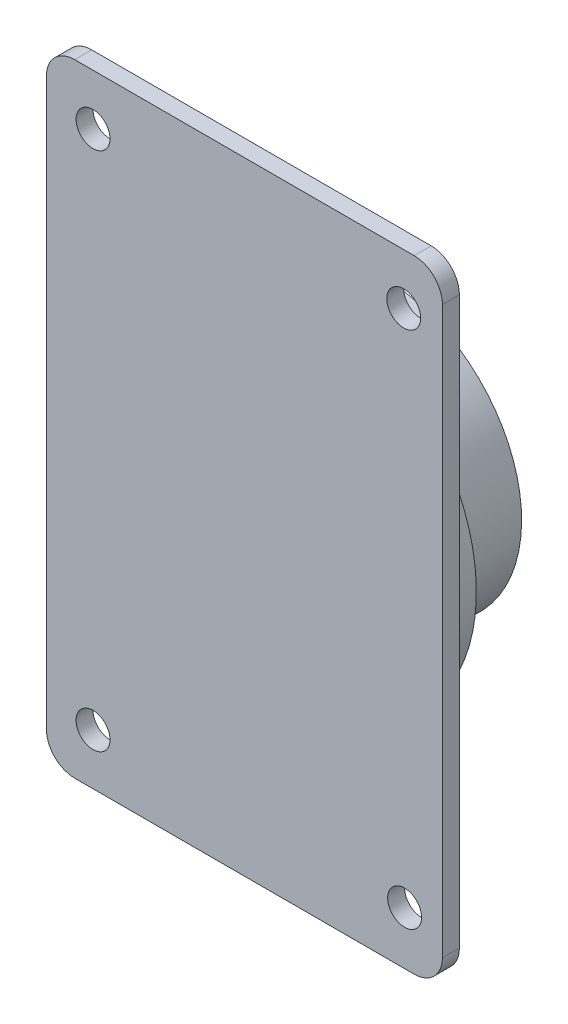
ISO-10303-21;
HEADER;
FILE_DESCRIPTION(('STEP AP214'),'2;1');
FILE_NAME('part.step','',(''),(''),'','','');
FILE_SCHEMA(('AUTOMOTIVE_DESIGN { 1 0 10303 214 1 1 1 1 }'));
ENDSEC;
DATA;
#1=APPLICATION_CONTEXT('core data for automotive mechanical design processes');
#2=APPLICATION_PROTOCOL_DEFINITION('international standard','automotive_design',2000,#1);
#3=PRODUCT_CONTEXT('',#1,'mechanical');
#4=PRODUCT('Part','Part','',(#3));
#5=PRODUCT_RELATED_PRODUCT_CATEGORY('part','',(#4));
#6=PRODUCT_DEFINITION_FORMATION('','',#4);
#7=PRODUCT_DEFINITION_CONTEXT('part definition',#1,'design');
#8=PRODUCT_DEFINITION('design','',#6,#7);
#9=PRODUCT_DEFINITION_SHAPE('','',#8);
#10=(LENGTH_UNIT() NAMED_UNIT(*) SI_UNIT(.MILLI.,.METRE.));
#11=(NAMED_UNIT(*) PLANE_ANGLE_UNIT() SI_UNIT($,.RADIAN.));
#12=(NAMED_UNIT(*) SI_UNIT($,.STERADIAN.) SOLID_ANGLE_UNIT());
#13=UNCERTAINTY_MEASURE_WITH_UNIT(LENGTH_MEASURE(1.E-05),#10,'distance_accuracy_value','');
#14=(GEOMETRIC_REPRESENTATION_CONTEXT(3) GLOBAL_UNCERTAINTY_ASSIGNED_CONTEXT((#13)) GLOBAL_UNIT_ASSIGNED_CONTEXT((#10,
#11,#12)) REPRESENTATION_CONTEXT('',''));
#15=CARTESIAN_POINT('',(0.,0.,0.));
#16=DIRECTION('',(0.,0.,1.));
#17=DIRECTION('',(1.,0.,0.));
#18=AXIS2_PLACEMENT_3D('',#15,#16,#17);
#19=CARTESIAN_POINT('',(0.,-3.14233320495882E-13,90.));
#20=DIRECTION('',(0.,0.,-1.));
#21=DIRECTION('',(0.,-1.,0.));
#22=AXIS2_PLACEMENT_3D('',#19,#20,#21);
#23=CYLINDRICAL_SURFACE('',#22,25.);
#24=CARTESIAN_POINT('',(0.,-3.14233320495882E-13,90.));
#25=DIRECTION('',(0.,0.,-1.));
#26=DIRECTION('',(0.,-1.,0.));
#27=AXIS2_PLACEMENT_3D('',#24,#25,#26);
#28=CIRCLE('',#27,25.);
#29=CARTESIAN_POINT('',(1.74574066942159E-13,-25.0000000000003,89.9999999999999));
#30=VERTEX_POINT('',#29);
#31=EDGE_CURVE('E146',#30,#30,#28,.T.);
#32=ORIENTED_EDGE('',*,*,#31,.T.);
#33=EDGE_LOOP('',(#32));
#34=FACE_BOUND('',#33,.T.);
#35=CARTESIAN_POINT('',(0.,-2.61861100413235E-13,75.));
#36=DIRECTION('',(0.,0.,-1.));
#37=DIRECTION('',(0.,-1.,0.));
#38=AXIS2_PLACEMENT_3D('',#35,#36,#37);
#39=CIRCLE('',#38,25.);
#40=CARTESIAN_POINT('',(1.74574066942158E-13,-25.0000000000003,74.9999999999999));
#41=VERTEX_POINT('',#40);
#42=EDGE_CURVE('E121',#41,#41,#39,.T.);
#43=ORIENTED_EDGE('',*,*,#42,.F.);
#44=EDGE_LOOP('',(#43));
#45=FACE_BOUND('',#44,.T.);
#46=ADVANCED_FACE('F34',(#34,#45),#23,.T.);
#47=CARTESIAN_POINT('',(0.,-2.61861100413235E-13,75.));
#48=DIRECTION('',(0.,0.,-1.));
#49=DIRECTION('',(0.,-1.,0.));
#50=AXIS2_PLACEMENT_3D('',#47,#48,#49);
#51=PLANE('',#50);
#52=ORIENTED_EDGE('',*,*,#42,.T.);
#53=EDGE_LOOP('',(#52));
#54=FACE_BOUND('',#53,.T.);
#55=ADVANCED_FACE('F206',(#54),#51,.T.);
#56=CARTESIAN_POINT('',(0.,-3.35182208528941E-13,96.));
#57=DIRECTION('',(0.,0.,-1.));
#58=DIRECTION('',(0.,-1.,0.));
#59=AXIS2_PLACEMENT_3D('',#56,#57,#58);
#60=CYLINDRICAL_SURFACE('',#59,32.);
#61=CARTESIAN_POINT('',(0.,-3.35182208528941E-13,96.));
#62=DIRECTION('',(0.,0.,1.));
#63=DIRECTION('',(0.,1.,0.));
#64=AXIS2_PLACEMENT_3D('',#61,#62,#63);
#65=CIRCLE('',#64,32.);
#66=CARTESIAN_POINT('',(-2.23454805685958E-13,31.9999999999997,96.0000000000001));
#67=VERTEX_POINT('',#66);
#68=EDGE_CURVE('E143',#67,#67,#65,.T.);
#69=ORIENTED_EDGE('',*,*,#68,.F.);
#70=EDGE_LOOP('',(#69));
#71=FACE_BOUND('',#70,.T.);
#72=CARTESIAN_POINT('',(0.,-3.14233320495882E-13,90.));
#73=DIRECTION('',(0.,0.,1.));
#74=DIRECTION('',(0.,1.,0.));
#75=AXIS2_PLACEMENT_3D('',#72,#73,#74);
#76=CIRCLE('',#75,32.);
#77=CARTESIAN_POINT('',(-2.23454805685958E-13,31.9999999999997,90.0000000000001));
#78=VERTEX_POINT('',#77);
#79=EDGE_CURVE('E147',#78,#78,#76,.T.);
#80=ORIENTED_EDGE('',*,*,#79,.T.);
#81=EDGE_LOOP('',(#80));
#82=FACE_BOUND('',#81,.T.);
#83=ADVANCED_FACE('F212',(#71,#82),#60,.T.);
#84=CARTESIAN_POINT('',(0.,-3.14233320495882E-13,90.));
#85=DIRECTION('',(0.,0.,1.));
#86=DIRECTION('',(0.,1.,0.));
#87=AXIS2_PLACEMENT_3D('',#84,#85,#86);
#88=PLANE('',#87);
#89=ORIENTED_EDGE('',*,*,#31,.F.);
#90=EDGE_LOOP('',(#89));
#91=FACE_BOUND('',#90,.T.);
#92=ORIENTED_EDGE('',*,*,#79,.F.);
#93=EDGE_LOOP('',(#92));
#94=FACE_BOUND('',#93,.T.);
#95=ADVANCED_FACE('F240',(#91,#94),#88,.F.);
#96=CARTESIAN_POINT('',(35.0000000000004,-55.0000000000001,98.9999999999998));
#97=DIRECTION('',(0.,1.,0.));
#98=DIRECTION('',(1.,0.,0.));
#99=AXIS2_PLACEMENT_3D('',#96,#97,#98);
#100=PLANE('',#99);
#101=DIRECTION('',(1.,0.,0.));
#102=VECTOR('',#101,1.);
#103=CARTESIAN_POINT('',(35.0000000000004,-55.0000000000001,95.9999999999998));
#104=LINE('',#103,#102);
#105=CARTESIAN_POINT('',(-29.9999999999996,-55.0000000000005,95.9999999999998));
#106=VERTEX_POINT('',#105);
#107=CARTESIAN_POINT('',(30.0000000000004,-55.0000000000001,95.9999999999998));
#108=VERTEX_POINT('',#107);
#109=EDGE_CURVE('E117',#106,#108,#104,.T.);
#110=ORIENTED_EDGE('',*,*,#109,.T.);
#111=DIRECTION('',(0.,0.,-1.));
#112=VECTOR('',#111,1.);
#113=CARTESIAN_POINT('',(30.0000000000004,-55.0000000000001,98.9999999999998));
#114=LINE('',#113,#112);
#115=CARTESIAN_POINT('',(30.0000000000004,-55.0000000000001,98.9999999999998));
#116=VERTEX_POINT('',#115);
#117=EDGE_CURVE('E167',#108,#116,#114,.F.);
#118=ORIENTED_EDGE('',*,*,#117,.T.);
#119=DIRECTION('',(1.,0.,0.));
#120=VECTOR('',#119,1.);
#121=CARTESIAN_POINT('',(35.0000000000004,-55.0000000000001,98.9999999999998));
#122=LINE('',#121,#120);
#123=CARTESIAN_POINT('',(-29.9999999999996,-55.0000000000005,98.9999999999998));
#124=VERTEX_POINT('',#123);
#125=EDGE_CURVE('E120',#124,#116,#122,.T.);
#126=ORIENTED_EDGE('',*,*,#125,.F.);
#127=DIRECTION('',(0.,0.,-1.));
#128=VECTOR('',#127,1.);
#129=CARTESIAN_POINT('',(-29.9999999999996,-55.0000000000005,98.9999999999998));
#130=LINE('',#129,#128);
#131=EDGE_CURVE('E106',#124,#106,#130,.T.);
#132=ORIENTED_EDGE('',*,*,#131,.T.);
#133=EDGE_LOOP('',(#110,#118,#126,#132));
#134=FACE_BOUND('',#133,.T.);
#135=ADVANCED_FACE('F116',(#134),#100,.F.);
#136=CARTESIAN_POINT('',(34.9999999999996,54.9999999999999,99.0000000000002));
#137=DIRECTION('',(-1.,0.,0.));
#138=DIRECTION('',(0.,1.,0.));
#139=AXIS2_PLACEMENT_3D('',#136,#137,#138);
#140=PLANE('',#139);
#141=DIRECTION('',(0.,1.,0.));
#142=VECTOR('',#141,1.);
#143=CARTESIAN_POINT('',(34.9999999999996,54.9999999999999,99.0000000000002));
#144=LINE('',#143,#142);
#145=CARTESIAN_POINT('',(35.0000000000003,-50.0000000000001,98.9999999999998));
#146=VERTEX_POINT('',#145);
#147=CARTESIAN_POINT('',(34.9999999999997,49.9999999999999,99.0000000000002));
#148=VERTEX_POINT('',#147);
#149=EDGE_CURVE('E186',#146,#148,#144,.T.);
#150=ORIENTED_EDGE('',*,*,#149,.F.);
#151=DIRECTION('',(0.,0.,-1.));
#152=VECTOR('',#151,1.);
#153=CARTESIAN_POINT('',(35.0000000000003,-50.0000000000001,98.9999999999998));
#154=LINE('',#153,#152);
#155=CARTESIAN_POINT('',(35.0000000000003,-50.0000000000001,95.9999999999998));
#156=VERTEX_POINT('',#155);
#157=EDGE_CURVE('E159',#146,#156,#154,.T.);
#158=ORIENTED_EDGE('',*,*,#157,.T.);
#159=DIRECTION('',(0.,1.,0.));
#160=VECTOR('',#159,1.);
#161=CARTESIAN_POINT('',(34.9999999999996,54.9999999999999,96.0000000000002));
#162=LINE('',#161,#160);
#163=CARTESIAN_POINT('',(34.9999999999997,49.9999999999999,96.0000000000002));
#164=VERTEX_POINT('',#163);
#165=EDGE_CURVE('E126',#156,#164,#162,.T.);
#166=ORIENTED_EDGE('',*,*,#165,.T.);
#167=DIRECTION('',(0.,0.,-1.));
#168=VECTOR('',#167,1.);
#169=CARTESIAN_POINT('',(34.9999999999997,49.9999999999999,99.0000000000002));
#170=LINE('',#169,#168);
#171=EDGE_CURVE('E157',#164,#148,#170,.F.);
#172=ORIENTED_EDGE('',*,*,#171,.T.);
#173=EDGE_LOOP('',(#150,#158,#166,#172));
#174=FACE_BOUND('',#173,.T.);
#175=ADVANCED_FACE('F231',(#174),#140,.F.);
#176=CARTESIAN_POINT('',(-35.0000000000004,54.9999999999994,99.0000000000002));
#177=DIRECTION('',(0.,-1.,0.));
#178=DIRECTION('',(-1.,0.,0.));
#179=AXIS2_PLACEMENT_3D('',#176,#177,#178);
#180=PLANE('',#179);
#181=DIRECTION('',(-1.,0.,0.));
#182=VECTOR('',#181,1.);
#183=CARTESIAN_POINT('',(-35.0000000000004,54.9999999999994,99.0000000000002));
#184=LINE('',#183,#182);
#185=CARTESIAN_POINT('',(29.9999999999996,54.9999999999999,99.0000000000002));
#186=VERTEX_POINT('',#185);
#187=CARTESIAN_POINT('',(-30.0000000000004,54.9999999999994,99.0000000000002));
#188=VERTEX_POINT('',#187);
#189=EDGE_CURVE('E136',#186,#188,#184,.T.);
#190=ORIENTED_EDGE('',*,*,#189,.F.);
#191=DIRECTION('',(0.,0.,-1.));
#192=VECTOR('',#191,1.);
#193=CARTESIAN_POINT('',(29.9999999999996,54.9999999999999,99.0000000000002));
#194=LINE('',#193,#192);
#195=CARTESIAN_POINT('',(29.9999999999996,54.9999999999999,96.0000000000002));
#196=VERTEX_POINT('',#195);
#197=EDGE_CURVE('E42',#186,#196,#194,.T.);
#198=ORIENTED_EDGE('',*,*,#197,.T.);
#199=DIRECTION('',(-1.,0.,0.));
#200=VECTOR('',#199,1.);
#201=CARTESIAN_POINT('',(-35.0000000000004,54.9999999999994,96.0000000000002));
#202=LINE('',#201,#200);
#203=CARTESIAN_POINT('',(-30.0000000000004,54.9999999999995,96.0000000000002));
#204=VERTEX_POINT('',#203);
#205=EDGE_CURVE('E130',#196,#204,#202,.T.);
#206=ORIENTED_EDGE('',*,*,#205,.T.);
#207=DIRECTION('',(0.,0.,-1.));
#208=VECTOR('',#207,1.);
#209=CARTESIAN_POINT('',(-30.0000000000004,54.9999999999994,99.0000000000002));
#210=LINE('',#209,#208);
#211=EDGE_CURVE('E49',#204,#188,#210,.F.);
#212=ORIENTED_EDGE('',*,*,#211,.T.);
#213=EDGE_LOOP('',(#190,#198,#206,#212));
#214=FACE_BOUND('',#213,.T.);
#215=ADVANCED_FACE('F177',(#214),#180,.F.);
#216=CARTESIAN_POINT('',(-35.,-5.9006034626449E-13,99.));
#217=DIRECTION('',(1.,0.,0.));
#218=DIRECTION('',(0.,-1.,0.));
#219=AXIS2_PLACEMENT_3D('',#216,#217,#218);
#220=PLANE('',#219);
#221=DIRECTION('',(0.,-1.,0.));
#222=VECTOR('',#221,1.);
#223=CARTESIAN_POINT('',(-34.9999999999996,-55.0000000000006,98.9999999999998));
#224=LINE('',#223,#222);
#225=CARTESIAN_POINT('',(-35.0000000000003,49.9999999999994,99.0000000000002));
#226=VERTEX_POINT('',#225);
#227=CARTESIAN_POINT('',(-34.9999999999997,-50.0000000000006,98.9999999999998));
#228=VERTEX_POINT('',#227);
#229=EDGE_CURVE('E142',#226,#228,#224,.T.);
#230=ORIENTED_EDGE('',*,*,#229,.F.);
#231=DIRECTION('',(0.,0.,-1.));
#232=VECTOR('',#231,1.);
#233=CARTESIAN_POINT('',(-35.0000000000004,49.9999999999994,99.0000000000002));
#234=LINE('',#233,#232);
#235=CARTESIAN_POINT('',(-35.0000000000004,49.9999999999994,96.0000000000002));
#236=VERTEX_POINT('',#235);
#237=EDGE_CURVE('E11',#226,#236,#234,.T.);
#238=ORIENTED_EDGE('',*,*,#237,.T.);
#239=DIRECTION('',(0.,-1.,0.));
#240=VECTOR('',#239,1.);
#241=CARTESIAN_POINT('',(-35.,-5.7958590224796E-13,96.));
#242=LINE('',#241,#240);
#243=CARTESIAN_POINT('',(-34.9999999999997,-50.0000000000006,95.9999999999998));
#244=VERTEX_POINT('',#243);
#245=EDGE_CURVE('E140',#236,#244,#242,.T.);
#246=ORIENTED_EDGE('',*,*,#245,.T.);
#247=DIRECTION('',(0.,0.,-1.));
#248=VECTOR('',#247,1.);
#249=CARTESIAN_POINT('',(-34.9999999999997,-50.0000000000006,98.9999999999998));
#250=LINE('',#249,#248);
#251=EDGE_CURVE('E108',#244,#228,#250,.F.);
#252=ORIENTED_EDGE('',*,*,#251,.T.);
#253=EDGE_LOOP('',(#230,#238,#246,#252));
#254=FACE_BOUND('',#253,.T.);
#255=ADVANCED_FACE('F184',(#254),#220,.F.);
#256=CARTESIAN_POINT('',(0.,-3.4565665254547E-13,99.));
#257=DIRECTION('',(0.,0.,-1.));
#258=DIRECTION('',(0.,-1.,0.));
#259=AXIS2_PLACEMENT_3D('',#256,#257,#258);
#260=PLANE('',#259);
#261=CARTESIAN_POINT('',(-26.7585235953473,-46.0000000000005,98.9999999999998));
#262=DIRECTION('',(0.,0.,1.));
#263=DIRECTION('',(0.,1.,0.));
#264=AXIS2_PLACEMENT_3D('',#261,#262,#263);
#265=CIRCLE('',#264,3.);
#266=CARTESIAN_POINT('',(-26.7585235953473,-43.0000000000005,98.9999999999999));
#267=VERTEX_POINT('',#266);
#268=EDGE_CURVE('E374',#267,#267,#265,.T.);
#269=ORIENTED_EDGE('',*,*,#268,.F.);
#270=EDGE_LOOP('',(#269));
#271=FACE_BOUND('',#270,.T.);
#272=CARTESIAN_POINT('',(28.1589709036038,45.9999999999998,99.0000000000002));
#273=DIRECTION('',(0.,0.,1.));
#274=DIRECTION('',(0.,1.,0.));
#275=AXIS2_PLACEMENT_3D('',#272,#273,#274);
#276=CIRCLE('',#275,3.);
#277=CARTESIAN_POINT('',(28.1589709036037,48.9999999999999,99.0000000000002));
#278=VERTEX_POINT('',#277);
#279=EDGE_CURVE('E377',#278,#278,#276,.T.);
#280=ORIENTED_EDGE('',*,*,#279,.F.);
#281=EDGE_LOOP('',(#280));
#282=FACE_BOUND('',#281,.T.);
#283=CARTESIAN_POINT('',(-26.7585235953479,45.9999999999995,99.0000000000002));
#284=DIRECTION('',(0.,0.,1.));
#285=DIRECTION('',(0.,1.,0.));
#286=AXIS2_PLACEMENT_3D('',#283,#284,#285);
#287=CIRCLE('',#286,3.);
#288=CARTESIAN_POINT('',(-26.7585235953479,48.9999999999995,99.0000000000002));
#289=VERTEX_POINT('',#288);
#290=EDGE_CURVE('E387',#289,#289,#287,.T.);
#291=ORIENTED_EDGE('',*,*,#290,.F.);
#292=EDGE_LOOP('',(#291));
#293=FACE_BOUND('',#292,.T.);
#294=CARTESIAN_POINT('',(28.320886721771,-45.6631454030907,98.9999999999998));
#295=DIRECTION('',(0.,0.,1.));
#296=DIRECTION('',(0.,1.,0.));
#297=AXIS2_PLACEMENT_3D('',#294,#295,#296);
#298=CIRCLE('',#297,3.);
#299=CARTESIAN_POINT('',(28.320886721771,-42.6631454030907,98.9999999999999));
#300=VERTEX_POINT('',#299);
#301=EDGE_CURVE('E133',#300,#300,#298,.T.);
#302=ORIENTED_EDGE('',*,*,#301,.F.);
#303=EDGE_LOOP('',(#302));
#304=FACE_BOUND('',#303,.T.);
#305=ORIENTED_EDGE('',*,*,#125,.T.);
#306=CARTESIAN_POINT('',(30.0000000000003,-50.0000000000001,98.9999999999998));
#307=DIRECTION('',(0.,0.,-1.));
#308=DIRECTION('',(0.,-1.,0.));
#309=AXIS2_PLACEMENT_3D('',#306,#307,#308);
#310=CIRCLE('',#309,5.);
#311=EDGE_CURVE('E172',#116,#146,#310,.F.);
#312=ORIENTED_EDGE('',*,*,#311,.T.);
#313=ORIENTED_EDGE('',*,*,#149,.T.);
#314=CARTESIAN_POINT('',(29.9999999999996,49.9999999999999,99.0000000000002));
#315=DIRECTION('',(0.,0.,-1.));
#316=DIRECTION('',(0.,-1.,0.));
#317=AXIS2_PLACEMENT_3D('',#314,#315,#316);
#318=CIRCLE('',#317,5.);
#319=EDGE_CURVE('E56',#148,#186,#318,.F.);
#320=ORIENTED_EDGE('',*,*,#319,.T.);
#321=ORIENTED_EDGE('',*,*,#189,.T.);
#322=CARTESIAN_POINT('',(-30.0000000000004,49.9999999999994,99.0000000000002));
#323=DIRECTION('',(0.,0.,-1.));
#324=DIRECTION('',(0.,-1.,0.));
#325=AXIS2_PLACEMENT_3D('',#322,#323,#324);
#326=CIRCLE('',#325,5.);
#327=EDGE_CURVE('E169',#188,#226,#326,.F.);
#328=ORIENTED_EDGE('',*,*,#327,.T.);
#329=ORIENTED_EDGE('',*,*,#229,.T.);
#330=CARTESIAN_POINT('',(-29.9999999999997,-50.0000000000006,98.9999999999998));
#331=DIRECTION('',(0.,0.,-1.));
#332=DIRECTION('',(0.,-1.,0.));
#333=AXIS2_PLACEMENT_3D('',#330,#331,#332);
#334=CIRCLE('',#333,5.);
#335=EDGE_CURVE('E155',#228,#124,#334,.F.);
#336=ORIENTED_EDGE('',*,*,#335,.T.);
#337=EDGE_LOOP('',(#305,#312,#313,#320,#321,#328,#329,#336));
#338=FACE_BOUND('',#337,.T.);
#339=ADVANCED_FACE('F190',(#271,#282,#293,#304,#338),#260,.F.);
#340=CARTESIAN_POINT('',(0.,-3.35182208528941E-13,96.));
#341=DIRECTION('',(0.,0.,-1.));
#342=DIRECTION('',(0.,-1.,0.));
#343=AXIS2_PLACEMENT_3D('',#340,#341,#342);
#344=PLANE('',#343);
#345=CARTESIAN_POINT('',(-26.7585235953473,-46.0000000000005,95.9999999999998));
#346=DIRECTION('',(0.,0.,1.));
#347=DIRECTION('',(0.,1.,0.));
#348=AXIS2_PLACEMENT_3D('',#345,#346,#347);
#349=CIRCLE('',#348,3.);
#350=CARTESIAN_POINT('',(-26.7585235953473,-43.0000000000005,95.9999999999999));
#351=VERTEX_POINT('',#350);
#352=EDGE_CURVE('E372',#351,#351,#349,.T.);
#353=ORIENTED_EDGE('',*,*,#352,.T.);
#354=EDGE_LOOP('',(#353));
#355=FACE_BOUND('',#354,.T.);
#356=CARTESIAN_POINT('',(28.1589709036038,45.9999999999999,96.0000000000002));
#357=DIRECTION('',(0.,0.,1.));
#358=DIRECTION('',(0.,1.,0.));
#359=AXIS2_PLACEMENT_3D('',#356,#357,#358);
#360=CIRCLE('',#359,3.);
#361=CARTESIAN_POINT('',(28.1589709036037,48.9999999999999,96.0000000000002));
#362=VERTEX_POINT('',#361);
#363=EDGE_CURVE('E385',#362,#362,#360,.T.);
#364=ORIENTED_EDGE('',*,*,#363,.T.);
#365=EDGE_LOOP('',(#364));
#366=FACE_BOUND('',#365,.T.);
#367=CARTESIAN_POINT('',(-26.7585235953479,45.9999999999995,96.0000000000002));
#368=DIRECTION('',(0.,0.,1.));
#369=DIRECTION('',(0.,1.,0.));
#370=AXIS2_PLACEMENT_3D('',#367,#368,#369);
#371=CIRCLE('',#370,3.);
#372=CARTESIAN_POINT('',(-26.7585235953479,48.9999999999995,96.0000000000002));
#373=VERTEX_POINT('',#372);
#374=EDGE_CURVE('E380',#373,#373,#371,.T.);
#375=ORIENTED_EDGE('',*,*,#374,.T.);
#376=EDGE_LOOP('',(#375));
#377=FACE_BOUND('',#376,.T.);
#378=CARTESIAN_POINT('',(28.320886721771,-45.6631454030907,95.9999999999998));
#379=DIRECTION('',(0.,0.,1.));
#380=DIRECTION('',(0.,1.,0.));
#381=AXIS2_PLACEMENT_3D('',#378,#379,#380);
#382=CIRCLE('',#381,3.);
#383=CARTESIAN_POINT('',(28.320886721771,-42.6631454030907,95.9999999999999));
#384=VERTEX_POINT('',#383);
#385=EDGE_CURVE('E127',#384,#384,#382,.T.);
#386=ORIENTED_EDGE('',*,*,#385,.T.);
#387=EDGE_LOOP('',(#386));
#388=FACE_BOUND('',#387,.T.);
#389=ORIENTED_EDGE('',*,*,#68,.T.);
#390=EDGE_LOOP('',(#389));
#391=FACE_BOUND('',#390,.T.);
#392=ORIENTED_EDGE('',*,*,#165,.F.);
#393=CARTESIAN_POINT('',(30.0000000000003,-50.0000000000001,95.9999999999998));
#394=DIRECTION('',(0.,0.,-1.));
#395=DIRECTION('',(0.,-1.,0.));
#396=AXIS2_PLACEMENT_3D('',#393,#394,#395);
#397=CIRCLE('',#396,5.);
#398=EDGE_CURVE('E125',#156,#108,#397,.T.);
#399=ORIENTED_EDGE('',*,*,#398,.T.);
#400=ORIENTED_EDGE('',*,*,#109,.F.);
#401=CARTESIAN_POINT('',(-29.9999999999997,-50.0000000000005,95.9999999999998));
#402=DIRECTION('',(0.,0.,-1.));
#403=DIRECTION('',(0.,-1.,0.));
#404=AXIS2_PLACEMENT_3D('',#401,#402,#403);
#405=CIRCLE('',#404,5.);
#406=EDGE_CURVE('E102',#106,#244,#405,.T.);
#407=ORIENTED_EDGE('',*,*,#406,.T.);
#408=ORIENTED_EDGE('',*,*,#245,.F.);
#409=CARTESIAN_POINT('',(-30.0000000000004,49.9999999999995,96.0000000000002));
#410=DIRECTION('',(0.,0.,-1.));
#411=DIRECTION('',(0.,-1.,0.));
#412=AXIS2_PLACEMENT_3D('',#409,#410,#411);
#413=CIRCLE('',#412,5.);
#414=EDGE_CURVE('E162',#236,#204,#413,.T.);
#415=ORIENTED_EDGE('',*,*,#414,.T.);
#416=ORIENTED_EDGE('',*,*,#205,.F.);
#417=CARTESIAN_POINT('',(29.9999999999996,49.9999999999999,96.0000000000002));
#418=DIRECTION('',(0.,0.,-1.));
#419=DIRECTION('',(0.,-1.,0.));
#420=AXIS2_PLACEMENT_3D('',#417,#418,#419);
#421=CIRCLE('',#420,5.);
#422=EDGE_CURVE('E164',#196,#164,#421,.T.);
#423=ORIENTED_EDGE('',*,*,#422,.T.);
#424=EDGE_LOOP('',(#392,#399,#400,#407,#408,#415,#416,#423));
#425=FACE_BOUND('',#424,.T.);
#426=ADVANCED_FACE('F124',(#355,#366,#377,#388,#391,#425),#344,.T.);
#427=CARTESIAN_POINT('',(-29.9999999999997,-50.0000000000006,98.9999999999998));
#428=DIRECTION('',(0.,0.,-1.));
#429=DIRECTION('',(0.,-1.,0.));
#430=AXIS2_PLACEMENT_3D('',#427,#428,#429);
#431=CYLINDRICAL_SURFACE('',#430,5.);
#432=ORIENTED_EDGE('',*,*,#335,.F.);
#433=ORIENTED_EDGE('',*,*,#251,.F.);
#434=ORIENTED_EDGE('',*,*,#406,.F.);
#435=ORIENTED_EDGE('',*,*,#131,.F.);
#436=EDGE_LOOP('',(#432,#433,#434,#435));
#437=FACE_BOUND('',#436,.T.);
#438=ADVANCED_FACE('F105',(#437),#431,.T.);
#439=CARTESIAN_POINT('',(30.0000000000003,-50.0000000000001,98.9999999999998));
#440=DIRECTION('',(0.,0.,-1.));
#441=DIRECTION('',(0.,-1.,0.));
#442=AXIS2_PLACEMENT_3D('',#439,#440,#441);
#443=CYLINDRICAL_SURFACE('',#442,5.);
#444=ORIENTED_EDGE('',*,*,#311,.F.);
#445=ORIENTED_EDGE('',*,*,#117,.F.);
#446=ORIENTED_EDGE('',*,*,#398,.F.);
#447=ORIENTED_EDGE('',*,*,#157,.F.);
#448=EDGE_LOOP('',(#444,#445,#446,#447));
#449=FACE_BOUND('',#448,.T.);
#450=ADVANCED_FACE('F220',(#449),#443,.T.);
#451=CARTESIAN_POINT('',(29.9999999999996,49.9999999999999,99.0000000000002));
#452=DIRECTION('',(0.,0.,-1.));
#453=DIRECTION('',(0.,-1.,0.));
#454=AXIS2_PLACEMENT_3D('',#451,#452,#453);
#455=CYLINDRICAL_SURFACE('',#454,5.);
#456=ORIENTED_EDGE('',*,*,#319,.F.);
#457=ORIENTED_EDGE('',*,*,#171,.F.);
#458=ORIENTED_EDGE('',*,*,#422,.F.);
#459=ORIENTED_EDGE('',*,*,#197,.F.);
#460=EDGE_LOOP('',(#456,#457,#458,#459));
#461=FACE_BOUND('',#460,.T.);
#462=ADVANCED_FACE('F222',(#461),#455,.T.);
#463=CARTESIAN_POINT('',(-30.0000000000004,49.9999999999994,99.0000000000002));
#464=DIRECTION('',(0.,0.,-1.));
#465=DIRECTION('',(0.,-1.,0.));
#466=AXIS2_PLACEMENT_3D('',#463,#464,#465);
#467=CYLINDRICAL_SURFACE('',#466,5.);
#468=ORIENTED_EDGE('',*,*,#327,.F.);
#469=ORIENTED_EDGE('',*,*,#211,.F.);
#470=ORIENTED_EDGE('',*,*,#414,.F.);
#471=ORIENTED_EDGE('',*,*,#237,.F.);
#472=EDGE_LOOP('',(#468,#469,#470,#471));
#473=FACE_BOUND('',#472,.T.);
#474=ADVANCED_FACE('F36',(#473),#467,.T.);
#475=CARTESIAN_POINT('',(28.320886721771,-45.6631454030907,95.9999999999998));
#476=DIRECTION('',(0.,0.,1.));
#477=DIRECTION('',(0.,1.,0.));
#478=AXIS2_PLACEMENT_3D('',#475,#476,#477);
#479=CYLINDRICAL_SURFACE('',#478,3.);
#480=ORIENTED_EDGE('',*,*,#385,.F.);
#481=EDGE_LOOP('',(#480));
#482=FACE_BOUND('',#481,.T.);
#483=ORIENTED_EDGE('',*,*,#301,.T.);
#484=EDGE_LOOP('',(#483));
#485=FACE_BOUND('',#484,.T.);
#486=ADVANCED_FACE('F228',(#482,#485),#479,.F.);
#487=CARTESIAN_POINT('',(-26.7585235953479,45.9999999999995,96.0000000000002));
#488=DIRECTION('',(0.,0.,1.));
#489=DIRECTION('',(0.,1.,0.));
#490=AXIS2_PLACEMENT_3D('',#487,#488,#489);
#491=CYLINDRICAL_SURFACE('',#490,3.);
#492=ORIENTED_EDGE('',*,*,#374,.F.);
#493=EDGE_LOOP('',(#492));
#494=FACE_BOUND('',#493,.T.);
#495=ORIENTED_EDGE('',*,*,#290,.T.);
#496=EDGE_LOOP('',(#495));
#497=FACE_BOUND('',#496,.T.);
#498=ADVANCED_FACE('F336',(#494,#497),#491,.F.);
#499=CARTESIAN_POINT('',(28.1589709036038,45.9999999999999,96.0000000000002));
#500=DIRECTION('',(0.,0.,1.));
#501=DIRECTION('',(0.,1.,0.));
#502=AXIS2_PLACEMENT_3D('',#499,#500,#501);
#503=CYLINDRICAL_SURFACE('',#502,3.);
#504=ORIENTED_EDGE('',*,*,#363,.F.);
#505=EDGE_LOOP('',(#504));
#506=FACE_BOUND('',#505,.T.);
#507=ORIENTED_EDGE('',*,*,#279,.T.);
#508=EDGE_LOOP('',(#507));
#509=FACE_BOUND('',#508,.T.);
#510=ADVANCED_FACE('F343',(#506,#509),#503,.F.);
#511=CARTESIAN_POINT('',(-26.7585235953473,-46.0000000000005,95.9999999999998));
#512=DIRECTION('',(0.,0.,1.));
#513=DIRECTION('',(0.,1.,0.));
#514=AXIS2_PLACEMENT_3D('',#511,#512,#513);
#515=CYLINDRICAL_SURFACE('',#514,3.);
#516=ORIENTED_EDGE('',*,*,#352,.F.);
#517=EDGE_LOOP('',(#516));
#518=FACE_BOUND('',#517,.T.);
#519=ORIENTED_EDGE('',*,*,#268,.T.);
#520=EDGE_LOOP('',(#519));
#521=FACE_BOUND('',#520,.T.);
#522=ADVANCED_FACE('F352',(#518,#521),#515,.F.);
#523=CLOSED_SHELL('',(#46,#55,#83,#95,#135,#175,#215,#255,#339,#426,#438,#450,#462,#474,#486,
#498,#510,#522));
#524=MANIFOLD_SOLID_BREP('B2',#523);
#525=ADVANCED_BREP_SHAPE_REPRESENTATION('',(#18,#524),#14);
#526=SHAPE_DEFINITION_REPRESENTATION(#9,#525);
ENDSEC;
END-ISO-10303-21;
